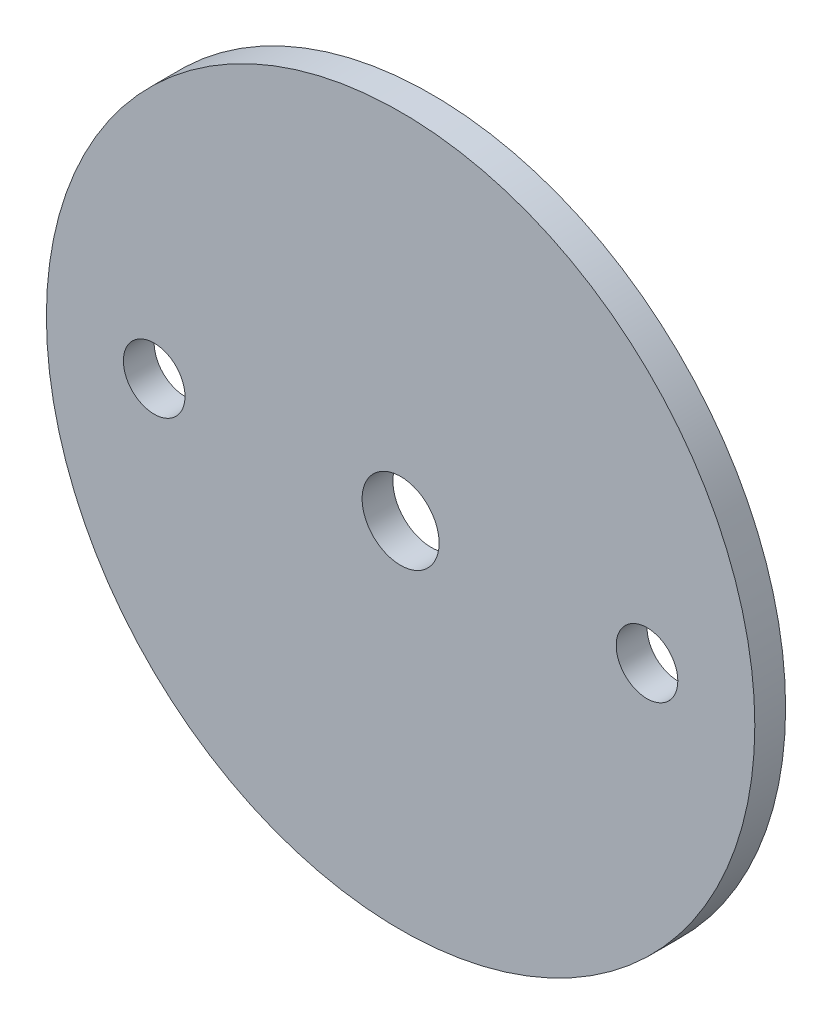
ISO-10303-21;
HEADER;
FILE_DESCRIPTION(('STEP AP214'),'2;1');
FILE_NAME('part.step','',(''),(''),'','','');
FILE_SCHEMA(('AUTOMOTIVE_DESIGN { 1 0 10303 214 1 1 1 1 }'));
ENDSEC;
DATA;
#1=APPLICATION_CONTEXT('core data for automotive mechanical design processes');
#2=APPLICATION_PROTOCOL_DEFINITION('international standard','automotive_design',2000,#1);
#3=PRODUCT_CONTEXT('',#1,'mechanical');
#4=PRODUCT('Part','Part','',(#3));
#5=PRODUCT_RELATED_PRODUCT_CATEGORY('part','',(#4));
#6=PRODUCT_DEFINITION_FORMATION('','',#4);
#7=PRODUCT_DEFINITION_CONTEXT('part definition',#1,'design');
#8=PRODUCT_DEFINITION('design','',#6,#7);
#9=PRODUCT_DEFINITION_SHAPE('','',#8);
#10=(LENGTH_UNIT() NAMED_UNIT(*) SI_UNIT(.MILLI.,.METRE.));
#11=(NAMED_UNIT(*) PLANE_ANGLE_UNIT() SI_UNIT($,.RADIAN.));
#12=(NAMED_UNIT(*) SI_UNIT($,.STERADIAN.) SOLID_ANGLE_UNIT());
#13=UNCERTAINTY_MEASURE_WITH_UNIT(LENGTH_MEASURE(1.E-05),#10,'distance_accuracy_value','');
#14=(GEOMETRIC_REPRESENTATION_CONTEXT(3) GLOBAL_UNCERTAINTY_ASSIGNED_CONTEXT((#13)) GLOBAL_UNIT_ASSIGNED_CONTEXT((#10,
#11,#12)) REPRESENTATION_CONTEXT('',''));
#15=CARTESIAN_POINT('',(0.,0.,0.));
#16=DIRECTION('',(0.,0.,1.));
#17=DIRECTION('',(1.,0.,0.));
#18=AXIS2_PLACEMENT_3D('',#15,#16,#17);
#19=CARTESIAN_POINT('',(0.,0.,1.5875));
#20=DIRECTION('',(0.,0.,-1.));
#21=DIRECTION('',(-1.,0.,0.));
#22=AXIS2_PLACEMENT_3D('',#19,#20,#21);
#23=CYLINDRICAL_SURFACE('',#22,36.5125);
#24=CARTESIAN_POINT('',(0.,0.,1.5875));
#25=DIRECTION('',(0.,0.,1.));
#26=DIRECTION('',(1.,0.,0.));
#27=AXIS2_PLACEMENT_3D('',#24,#25,#26);
#28=CIRCLE('',#27,36.5125);
#29=CARTESIAN_POINT('',(36.5125,0.,1.5875));
#30=VERTEX_POINT('',#29);
#31=EDGE_CURVE('E10',#30,#30,#28,.T.);
#32=ORIENTED_EDGE('',*,*,#31,.F.);
#33=EDGE_LOOP('',(#32));
#34=FACE_BOUND('',#33,.T.);
#35=CARTESIAN_POINT('',(0.,0.,-1.5875));
#36=DIRECTION('',(0.,0.,1.));
#37=DIRECTION('',(1.,0.,0.));
#38=AXIS2_PLACEMENT_3D('',#35,#36,#37);
#39=CIRCLE('',#38,36.5125);
#40=CARTESIAN_POINT('',(36.5125,0.,-1.5875));
#41=VERTEX_POINT('',#40);
#42=EDGE_CURVE('E40',#41,#41,#39,.T.);
#43=ORIENTED_EDGE('',*,*,#42,.T.);
#44=EDGE_LOOP('',(#43));
#45=FACE_BOUND('',#44,.T.);
#46=ADVANCED_FACE('F37',(#34,#45),#23,.T.);
#47=CARTESIAN_POINT('',(0.,0.,1.5875));
#48=DIRECTION('',(0.,0.,1.));
#49=DIRECTION('',(1.,0.,0.));
#50=AXIS2_PLACEMENT_3D('',#47,#48,#49);
#51=PLANE('',#50);
#52=CARTESIAN_POINT('',(0.,0.,1.5875));
#53=DIRECTION('',(0.,0.,1.));
#54=DIRECTION('',(1.,0.,0.));
#55=AXIS2_PLACEMENT_3D('',#52,#53,#54);
#56=CIRCLE('',#55,3.96875);
#57=CARTESIAN_POINT('',(3.96875,0.,1.5875));
#58=VERTEX_POINT('',#57);
#59=EDGE_CURVE('E63',#58,#58,#56,.T.);
#60=ORIENTED_EDGE('',*,*,#59,.F.);
#61=EDGE_LOOP('',(#60));
#62=FACE_BOUND('',#61,.T.);
#63=CARTESIAN_POINT('',(25.4,0.,1.5875));
#64=DIRECTION('',(0.,0.,1.));
#65=DIRECTION('',(1.,0.,0.));
#66=AXIS2_PLACEMENT_3D('',#63,#64,#65);
#67=CIRCLE('',#66,3.17499999999999);
#68=CARTESIAN_POINT('',(28.575,0.,1.5875));
#69=VERTEX_POINT('',#68);
#70=EDGE_CURVE('E57',#69,#69,#67,.T.);
#71=ORIENTED_EDGE('',*,*,#70,.F.);
#72=EDGE_LOOP('',(#71));
#73=FACE_BOUND('',#72,.T.);
#74=CARTESIAN_POINT('',(-25.4,0.,1.5875));
#75=DIRECTION('',(0.,0.,1.));
#76=DIRECTION('',(1.,0.,0.));
#77=AXIS2_PLACEMENT_3D('',#74,#75,#76);
#78=CIRCLE('',#77,3.17499999999999);
#79=CARTESIAN_POINT('',(-22.225,0.,1.5875));
#80=VERTEX_POINT('',#79);
#81=EDGE_CURVE('E51',#80,#80,#78,.T.);
#82=ORIENTED_EDGE('',*,*,#81,.F.);
#83=EDGE_LOOP('',(#82));
#84=FACE_BOUND('',#83,.T.);
#85=ORIENTED_EDGE('',*,*,#31,.T.);
#86=EDGE_LOOP('',(#85));
#87=FACE_BOUND('',#86,.T.);
#88=ADVANCED_FACE('F70',(#62,#73,#84,#87),#51,.T.);
#89=CARTESIAN_POINT('',(0.,0.,-1.5875));
#90=DIRECTION('',(0.,0.,1.));
#91=DIRECTION('',(1.,0.,0.));
#92=AXIS2_PLACEMENT_3D('',#89,#90,#91);
#93=PLANE('',#92);
#94=CARTESIAN_POINT('',(0.,0.,-1.5875));
#95=DIRECTION('',(0.,0.,1.));
#96=DIRECTION('',(1.,0.,0.));
#97=AXIS2_PLACEMENT_3D('',#94,#95,#96);
#98=CIRCLE('',#97,3.96875);
#99=CARTESIAN_POINT('',(3.96875,0.,-1.5875));
#100=VERTEX_POINT('',#99);
#101=EDGE_CURVE('E60',#100,#100,#98,.T.);
#102=ORIENTED_EDGE('',*,*,#101,.T.);
#103=EDGE_LOOP('',(#102));
#104=FACE_BOUND('',#103,.T.);
#105=CARTESIAN_POINT('',(25.4,0.,-1.5875));
#106=DIRECTION('',(0.,0.,1.));
#107=DIRECTION('',(1.,0.,0.));
#108=AXIS2_PLACEMENT_3D('',#105,#106,#107);
#109=CIRCLE('',#108,3.175);
#110=CARTESIAN_POINT('',(28.575,0.,-1.5875));
#111=VERTEX_POINT('',#110);
#112=EDGE_CURVE('E54',#111,#111,#109,.T.);
#113=ORIENTED_EDGE('',*,*,#112,.T.);
#114=EDGE_LOOP('',(#113));
#115=FACE_BOUND('',#114,.T.);
#116=CARTESIAN_POINT('',(-25.4,0.,-1.5875));
#117=DIRECTION('',(0.,0.,1.));
#118=DIRECTION('',(1.,0.,0.));
#119=AXIS2_PLACEMENT_3D('',#116,#117,#118);
#120=CIRCLE('',#119,3.175);
#121=CARTESIAN_POINT('',(-22.225,0.,-1.5875));
#122=VERTEX_POINT('',#121);
#123=EDGE_CURVE('E47',#122,#122,#120,.T.);
#124=ORIENTED_EDGE('',*,*,#123,.T.);
#125=EDGE_LOOP('',(#124));
#126=FACE_BOUND('',#125,.T.);
#127=ORIENTED_EDGE('',*,*,#42,.F.);
#128=EDGE_LOOP('',(#127));
#129=FACE_BOUND('',#128,.T.);
#130=ADVANCED_FACE('F73',(#104,#115,#126,#129),#93,.F.);
#131=CARTESIAN_POINT('',(-25.4,0.,1.5875));
#132=DIRECTION('',(0.,0.,1.));
#133=DIRECTION('',(1.,0.,0.));
#134=AXIS2_PLACEMENT_3D('',#131,#132,#133);
#135=CYLINDRICAL_SURFACE('',#134,3.17499999999999);
#136=ORIENTED_EDGE('',*,*,#123,.F.);
#137=EDGE_LOOP('',(#136));
#138=FACE_BOUND('',#137,.T.);
#139=ORIENTED_EDGE('',*,*,#81,.T.);
#140=EDGE_LOOP('',(#139));
#141=FACE_BOUND('',#140,.T.);
#142=ADVANCED_FACE('F79',(#138,#141),#135,.F.);
#143=CARTESIAN_POINT('',(25.4,0.,1.5875));
#144=DIRECTION('',(0.,0.,1.));
#145=DIRECTION('',(1.,0.,0.));
#146=AXIS2_PLACEMENT_3D('',#143,#144,#145);
#147=CYLINDRICAL_SURFACE('',#146,3.17499999999999);
#148=ORIENTED_EDGE('',*,*,#112,.F.);
#149=EDGE_LOOP('',(#148));
#150=FACE_BOUND('',#149,.T.);
#151=ORIENTED_EDGE('',*,*,#70,.T.);
#152=EDGE_LOOP('',(#151));
#153=FACE_BOUND('',#152,.T.);
#154=ADVANCED_FACE('F81',(#150,#153),#147,.F.);
#155=CARTESIAN_POINT('',(0.,0.,1.5875));
#156=DIRECTION('',(0.,0.,1.));
#157=DIRECTION('',(1.,0.,0.));
#158=AXIS2_PLACEMENT_3D('',#155,#156,#157);
#159=CYLINDRICAL_SURFACE('',#158,3.96875);
#160=ORIENTED_EDGE('',*,*,#59,.T.);
#161=EDGE_LOOP('',(#160));
#162=FACE_BOUND('',#161,.T.);
#163=ORIENTED_EDGE('',*,*,#101,.F.);
#164=EDGE_LOOP('',(#163));
#165=FACE_BOUND('',#164,.T.);
#166=ADVANCED_FACE('F67',(#162,#165),#159,.F.);
#167=CLOSED_SHELL('',(#46,#88,#130,#142,#154,#166));
#168=MANIFOLD_SOLID_BREP('B2',#167);
#169=ADVANCED_BREP_SHAPE_REPRESENTATION('',(#18,#168),#14);
#170=SHAPE_DEFINITION_REPRESENTATION(#9,#169);
ENDSEC;
END-ISO-10303-21;
